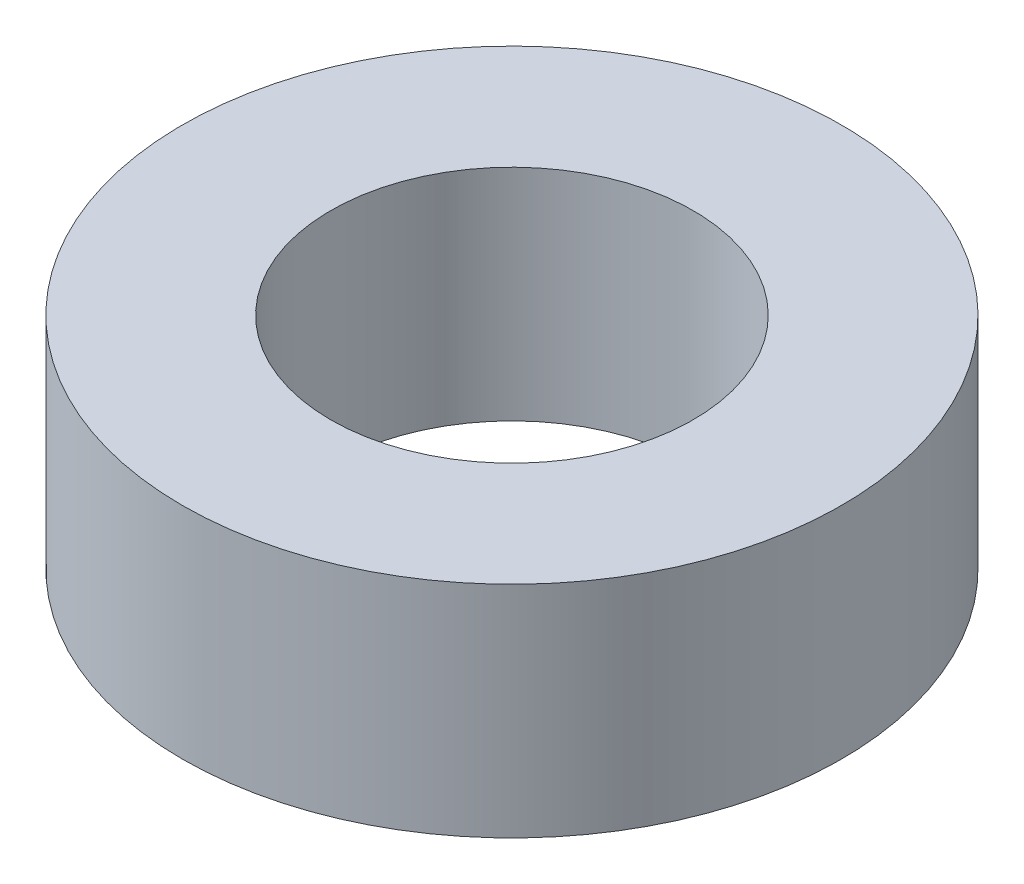
ISO-10303-21;
HEADER;
FILE_DESCRIPTION(('STEP AP214'),'2;1');
FILE_NAME('part.step','',(''),(''),'','','');
FILE_SCHEMA(('AUTOMOTIVE_DESIGN { 1 0 10303 214 1 1 1 1 }'));
ENDSEC;
DATA;
#1=APPLICATION_CONTEXT('core data for automotive mechanical design processes');
#2=APPLICATION_PROTOCOL_DEFINITION('international standard','automotive_design',2000,#1);
#3=PRODUCT_CONTEXT('',#1,'mechanical');
#4=PRODUCT('Part','Part','',(#3));
#5=PRODUCT_RELATED_PRODUCT_CATEGORY('part','',(#4));
#6=PRODUCT_DEFINITION_FORMATION('','',#4);
#7=PRODUCT_DEFINITION_CONTEXT('part definition',#1,'design');
#8=PRODUCT_DEFINITION('design','',#6,#7);
#9=PRODUCT_DEFINITION_SHAPE('','',#8);
#10=(LENGTH_UNIT() NAMED_UNIT(*) SI_UNIT(.MILLI.,.METRE.));
#11=(NAMED_UNIT(*) PLANE_ANGLE_UNIT() SI_UNIT($,.RADIAN.));
#12=(NAMED_UNIT(*) SI_UNIT($,.STERADIAN.) SOLID_ANGLE_UNIT());
#13=UNCERTAINTY_MEASURE_WITH_UNIT(LENGTH_MEASURE(1.E-05),#10,'distance_accuracy_value','');
#14=(GEOMETRIC_REPRESENTATION_CONTEXT(3) GLOBAL_UNCERTAINTY_ASSIGNED_CONTEXT((#13)) GLOBAL_UNIT_ASSIGNED_CONTEXT((#10,
#11,#12)) REPRESENTATION_CONTEXT('',''));
#15=CARTESIAN_POINT('',(0.,0.,0.));
#16=DIRECTION('',(0.,0.,1.));
#17=DIRECTION('',(1.,0.,0.));
#18=AXIS2_PLACEMENT_3D('',#15,#16,#17);
#19=CARTESIAN_POINT('',(0.,2.,0.));
#20=DIRECTION('',(0.,1.,0.));
#21=DIRECTION('',(0.,0.,1.));
#22=AXIS2_PLACEMENT_3D('',#19,#20,#21);
#23=PLANE('',#22);
#24=CARTESIAN_POINT('',(0.,2.,0.));
#25=DIRECTION('',(0.,1.,0.));
#26=DIRECTION('',(0.,0.,1.));
#27=AXIS2_PLACEMENT_3D('',#24,#25,#26);
#28=CIRCLE('',#27,3.);
#29=CARTESIAN_POINT('',(0.,2.,3.));
#30=VERTEX_POINT('',#29);
#31=EDGE_CURVE('E10',#30,#30,#28,.T.);
#32=ORIENTED_EDGE('',*,*,#31,.T.);
#33=EDGE_LOOP('',(#32));
#34=FACE_BOUND('',#33,.T.);
#35=CARTESIAN_POINT('',(0.,2.,0.));
#36=DIRECTION('',(0.,1.,0.));
#37=DIRECTION('',(0.,0.,1.));
#38=AXIS2_PLACEMENT_3D('',#35,#36,#37);
#39=CIRCLE('',#38,1.65);
#40=CARTESIAN_POINT('',(0.,2.,1.65));
#41=VERTEX_POINT('',#40);
#42=EDGE_CURVE('E45',#41,#41,#39,.T.);
#43=ORIENTED_EDGE('',*,*,#42,.F.);
#44=EDGE_LOOP('',(#43));
#45=FACE_BOUND('',#44,.T.);
#46=ADVANCED_FACE('F34',(#34,#45),#23,.T.);
#47=CARTESIAN_POINT('',(0.,0.,0.));
#48=DIRECTION('',(0.,1.,0.));
#49=DIRECTION('',(0.,0.,1.));
#50=AXIS2_PLACEMENT_3D('',#47,#48,#49);
#51=PLANE('',#50);
#52=CARTESIAN_POINT('',(0.,0.,0.));
#53=DIRECTION('',(0.,1.,0.));
#54=DIRECTION('',(0.,0.,1.));
#55=AXIS2_PLACEMENT_3D('',#52,#53,#54);
#56=CIRCLE('',#55,3.);
#57=CARTESIAN_POINT('',(0.,0.,3.));
#58=VERTEX_POINT('',#57);
#59=EDGE_CURVE('E38',#58,#58,#56,.T.);
#60=ORIENTED_EDGE('',*,*,#59,.F.);
#61=EDGE_LOOP('',(#60));
#62=FACE_BOUND('',#61,.T.);
#63=CARTESIAN_POINT('',(0.,0.,0.));
#64=DIRECTION('',(0.,1.,0.));
#65=DIRECTION('',(0.,0.,1.));
#66=AXIS2_PLACEMENT_3D('',#63,#64,#65);
#67=CIRCLE('',#66,1.65);
#68=CARTESIAN_POINT('',(0.,0.,1.65));
#69=VERTEX_POINT('',#68);
#70=EDGE_CURVE('E47',#69,#69,#67,.T.);
#71=ORIENTED_EDGE('',*,*,#70,.T.);
#72=EDGE_LOOP('',(#71));
#73=FACE_BOUND('',#72,.T.);
#74=ADVANCED_FACE('F57',(#62,#73),#51,.F.);
#75=CARTESIAN_POINT('',(0.,2.,0.));
#76=DIRECTION('',(0.,-1.,0.));
#77=DIRECTION('',(0.,0.,-1.));
#78=AXIS2_PLACEMENT_3D('',#75,#76,#77);
#79=CYLINDRICAL_SURFACE('',#78,3.);
#80=ORIENTED_EDGE('',*,*,#31,.F.);
#81=EDGE_LOOP('',(#80));
#82=FACE_BOUND('',#81,.T.);
#83=ORIENTED_EDGE('',*,*,#59,.T.);
#84=EDGE_LOOP('',(#83));
#85=FACE_BOUND('',#84,.T.);
#86=ADVANCED_FACE('F36',(#82,#85),#79,.T.);
#87=CARTESIAN_POINT('',(0.,2.,0.));
#88=DIRECTION('',(0.,-1.,0.));
#89=DIRECTION('',(0.,0.,-1.));
#90=AXIS2_PLACEMENT_3D('',#87,#88,#89);
#91=CYLINDRICAL_SURFACE('',#90,1.65);
#92=ORIENTED_EDGE('',*,*,#42,.T.);
#93=EDGE_LOOP('',(#92));
#94=FACE_BOUND('',#93,.T.);
#95=ORIENTED_EDGE('',*,*,#70,.F.);
#96=EDGE_LOOP('',(#95));
#97=FACE_BOUND('',#96,.T.);
#98=ADVANCED_FACE('F53',(#94,#97),#91,.F.);
#99=CLOSED_SHELL('',(#46,#74,#86,#98));
#100=MANIFOLD_SOLID_BREP('B2',#99);
#101=ADVANCED_BREP_SHAPE_REPRESENTATION('',(#18,#100),#14);
#102=SHAPE_DEFINITION_REPRESENTATION(#9,#101);
ENDSEC;
END-ISO-10303-21;
